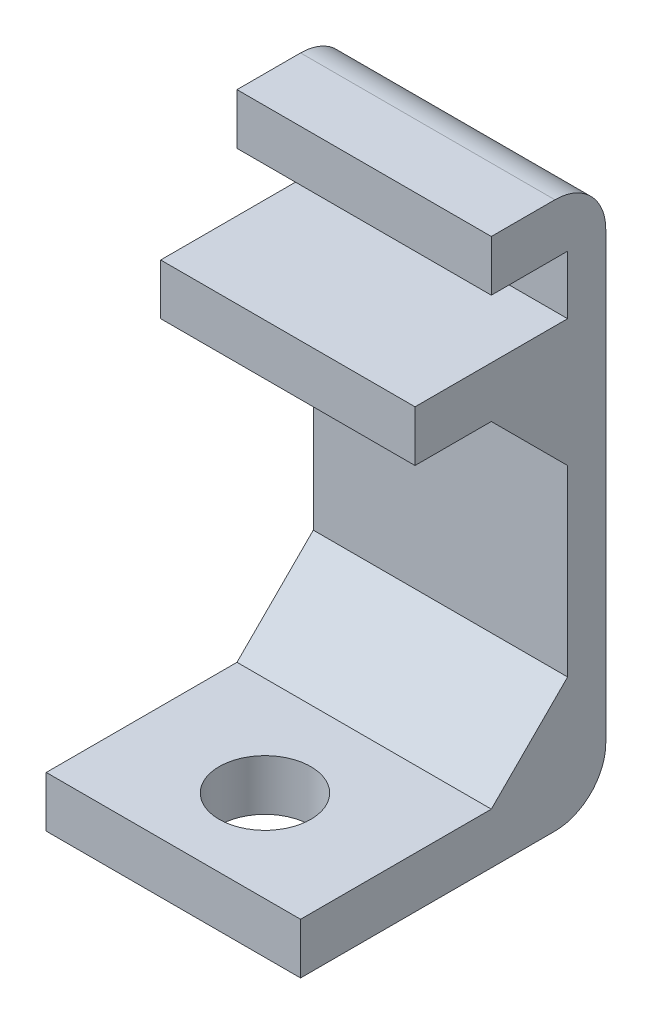
ISO-10303-21;
HEADER;
FILE_DESCRIPTION(('STEP AP214'),'2;1');
FILE_NAME('part.step','',(''),(''),'','','');
FILE_SCHEMA(('AUTOMOTIVE_DESIGN { 1 0 10303 214 1 1 1 1 }'));
ENDSEC;
DATA;
#1=APPLICATION_CONTEXT('core data for automotive mechanical design processes');
#2=APPLICATION_PROTOCOL_DEFINITION('international standard','automotive_design',2000,#1);
#3=PRODUCT_CONTEXT('',#1,'mechanical');
#4=PRODUCT('Part','Part','',(#3));
#5=PRODUCT_RELATED_PRODUCT_CATEGORY('part','',(#4));
#6=PRODUCT_DEFINITION_FORMATION('','',#4);
#7=PRODUCT_DEFINITION_CONTEXT('part definition',#1,'design');
#8=PRODUCT_DEFINITION('design','',#6,#7);
#9=PRODUCT_DEFINITION_SHAPE('','',#8);
#10=(LENGTH_UNIT() NAMED_UNIT(*) SI_UNIT(.MILLI.,.METRE.));
#11=(NAMED_UNIT(*) PLANE_ANGLE_UNIT() SI_UNIT($,.RADIAN.));
#12=(NAMED_UNIT(*) SI_UNIT($,.STERADIAN.) SOLID_ANGLE_UNIT());
#13=UNCERTAINTY_MEASURE_WITH_UNIT(LENGTH_MEASURE(1.E-05),#10,'distance_accuracy_value','');
#14=(GEOMETRIC_REPRESENTATION_CONTEXT(3) GLOBAL_UNCERTAINTY_ASSIGNED_CONTEXT((#13)) GLOBAL_UNIT_ASSIGNED_CONTEXT((#10,
#11,#12)) REPRESENTATION_CONTEXT('',''));
#15=CARTESIAN_POINT('',(0.,0.,0.));
#16=DIRECTION('',(0.,0.,1.));
#17=DIRECTION('',(1.,0.,0.));
#18=AXIS2_PLACEMENT_3D('',#15,#16,#17);
#19=CARTESIAN_POINT('',(5.,0.,0.750000000000002));
#20=DIRECTION('',(0.,0.,-1.));
#21=DIRECTION('',(-1.,0.,0.));
#22=AXIS2_PLACEMENT_3D('',#19,#20,#21);
#23=PLANE('',#22);
#24=DIRECTION('',(0.,-1.,0.));
#25=VECTOR('',#24,1.);
#26=CARTESIAN_POINT('',(-5.,0.,0.750000000000002));
#27=LINE('',#26,#25);
#28=CARTESIAN_POINT('',(-5.,6.45,0.750000000000002));
#29=VERTEX_POINT('',#28);
#30=CARTESIAN_POINT('',(-5.,4.45,0.750000000000002));
#31=VERTEX_POINT('',#30);
#32=EDGE_CURVE('E180',#29,#31,#27,.T.);
#33=ORIENTED_EDGE('',*,*,#32,.T.);
#34=DIRECTION('',(-1.,0.,0.));
#35=VECTOR('',#34,1.);
#36=CARTESIAN_POINT('',(5.,4.45,0.750000000000002));
#37=LINE('',#36,#35);
#38=CARTESIAN_POINT('',(5.,4.45,0.750000000000002));
#39=VERTEX_POINT('',#38);
#40=EDGE_CURVE('E163',#39,#31,#37,.T.);
#41=ORIENTED_EDGE('',*,*,#40,.F.);
#42=DIRECTION('',(0.,-1.,0.));
#43=VECTOR('',#42,1.);
#44=CARTESIAN_POINT('',(5.,0.,0.750000000000002));
#45=LINE('',#44,#43);
#46=CARTESIAN_POINT('',(5.,6.45,0.750000000000002));
#47=VERTEX_POINT('',#46);
#48=EDGE_CURVE('E169',#47,#39,#45,.T.);
#49=ORIENTED_EDGE('',*,*,#48,.F.);
#50=DIRECTION('',(-1.,0.,0.));
#51=VECTOR('',#50,1.);
#52=CARTESIAN_POINT('',(5.,6.45,0.750000000000002));
#53=LINE('',#52,#51);
#54=EDGE_CURVE('E256',#47,#29,#53,.T.);
#55=ORIENTED_EDGE('',*,*,#54,.T.);
#56=EDGE_LOOP('',(#33,#41,#49,#55));
#57=FACE_BOUND('',#56,.T.);
#58=ADVANCED_FACE('F41',(#57),#23,.F.);
#59=CARTESIAN_POINT('',(5.,4.45,0.));
#60=DIRECTION('',(0.,1.,0.));
#61=DIRECTION('',(0.,0.,1.));
#62=AXIS2_PLACEMENT_3D('',#59,#60,#61);
#63=PLANE('',#62);
#64=DIRECTION('',(0.,0.,-1.));
#65=VECTOR('',#64,1.);
#66=CARTESIAN_POINT('',(-5.,4.45,0.));
#67=LINE('',#66,#65);
#68=CARTESIAN_POINT('',(-5.,4.45,-2.25000000000001));
#69=VERTEX_POINT('',#68);
#70=EDGE_CURVE('E336',#31,#69,#67,.T.);
#71=ORIENTED_EDGE('',*,*,#70,.T.);
#72=DIRECTION('',(1.,0.,0.));
#73=VECTOR('',#72,1.);
#74=CARTESIAN_POINT('',(5.,4.45,-2.25000000000001));
#75=LINE('',#74,#73);
#76=CARTESIAN_POINT('',(5.,4.45,-2.25000000000001));
#77=VERTEX_POINT('',#76);
#78=EDGE_CURVE('E166',#69,#77,#75,.T.);
#79=ORIENTED_EDGE('',*,*,#78,.T.);
#80=DIRECTION('',(0.,0.,-1.));
#81=VECTOR('',#80,1.);
#82=CARTESIAN_POINT('',(5.,4.45,0.));
#83=LINE('',#82,#81);
#84=EDGE_CURVE('E158',#39,#77,#83,.T.);
#85=ORIENTED_EDGE('',*,*,#84,.F.);
#86=ORIENTED_EDGE('',*,*,#40,.T.);
#87=EDGE_LOOP('',(#71,#79,#85,#86));
#88=FACE_BOUND('',#87,.T.);
#89=ADVANCED_FACE('F161',(#88),#63,.F.);
#90=CARTESIAN_POINT('',(5.,0.,-5.25));
#91=DIRECTION('',(0.,0.,-1.));
#92=DIRECTION('',(-1.,0.,0.));
#93=AXIS2_PLACEMENT_3D('',#90,#91,#92);
#94=PLANE('',#93);
#95=DIRECTION('',(0.,-1.,0.));
#96=VECTOR('',#95,1.);
#97=CARTESIAN_POINT('',(-5.,0.,-5.25));
#98=LINE('',#97,#96);
#99=CARTESIAN_POINT('',(-5.,1.44999999999998,-5.25));
#100=VERTEX_POINT('',#99);
#101=CARTESIAN_POINT('',(-5.,-5.75000000000001,-5.25));
#102=VERTEX_POINT('',#101);
#103=EDGE_CURVE('E339',#100,#102,#98,.T.);
#104=ORIENTED_EDGE('',*,*,#103,.T.);
#105=DIRECTION('',(1.,0.,0.));
#106=VECTOR('',#105,1.);
#107=CARTESIAN_POINT('',(5.,-5.75000000000001,-5.25));
#108=LINE('',#107,#106);
#109=CARTESIAN_POINT('',(5.,-5.75000000000001,-5.25));
#110=VERTEX_POINT('',#109);
#111=EDGE_CURVE('E193',#102,#110,#108,.T.);
#112=ORIENTED_EDGE('',*,*,#111,.T.);
#113=DIRECTION('',(0.,-1.,0.));
#114=VECTOR('',#113,1.);
#115=CARTESIAN_POINT('',(5.,0.,-5.25));
#116=LINE('',#115,#114);
#117=CARTESIAN_POINT('',(5.,1.44999999999998,-5.25));
#118=VERTEX_POINT('',#117);
#119=EDGE_CURVE('E168',#118,#110,#116,.T.);
#120=ORIENTED_EDGE('',*,*,#119,.F.);
#121=DIRECTION('',(-1.,0.,0.));
#122=VECTOR('',#121,1.);
#123=CARTESIAN_POINT('',(-5.,1.44999999999998,-5.25));
#124=LINE('',#123,#122);
#125=EDGE_CURVE('E185',#118,#100,#124,.T.);
#126=ORIENTED_EDGE('',*,*,#125,.T.);
#127=EDGE_LOOP('',(#104,#112,#120,#126));
#128=FACE_BOUND('',#127,.T.);
#129=ADVANCED_FACE('F290',(#128),#94,.F.);
#130=CARTESIAN_POINT('',(5.,-8.75,0.));
#131=DIRECTION('',(0.,1.,0.));
#132=DIRECTION('',(0.,0.,1.));
#133=AXIS2_PLACEMENT_3D('',#130,#131,#132);
#134=PLANE('',#133);
#135=CARTESIAN_POINT('',(0.,-8.75,1.65));
#136=DIRECTION('',(0.,1.,0.));
#137=DIRECTION('',(0.,0.,1.));
#138=AXIS2_PLACEMENT_3D('',#135,#136,#137);
#139=CIRCLE('',#138,1.8);
#140=CARTESIAN_POINT('',(0.,-8.75,3.45));
#141=VERTEX_POINT('',#140);
#142=EDGE_CURVE('E337',#141,#141,#139,.F.);
#143=ORIENTED_EDGE('',*,*,#142,.T.);
#144=EDGE_LOOP('',(#143));
#145=FACE_BOUND('',#144,.T.);
#146=DIRECTION('',(0.,0.,-1.));
#147=VECTOR('',#146,1.);
#148=CARTESIAN_POINT('',(5.,-8.75,0.));
#149=LINE('',#148,#147);
#150=CARTESIAN_POINT('',(5.,-8.75,5.25));
#151=VERTEX_POINT('',#150);
#152=CARTESIAN_POINT('',(5.,-8.75,-2.24999999999998));
#153=VERTEX_POINT('',#152);
#154=EDGE_CURVE('E320',#151,#153,#149,.T.);
#155=ORIENTED_EDGE('',*,*,#154,.T.);
#156=DIRECTION('',(-1.,0.,0.));
#157=VECTOR('',#156,1.);
#158=CARTESIAN_POINT('',(5.,-8.75,-2.24999999999998));
#159=LINE('',#158,#157);
#160=CARTESIAN_POINT('',(-5.,-8.75,-2.24999999999998));
#161=VERTEX_POINT('',#160);
#162=EDGE_CURVE('E181',#153,#161,#159,.T.);
#163=ORIENTED_EDGE('',*,*,#162,.T.);
#164=DIRECTION('',(0.,0.,-1.));
#165=VECTOR('',#164,1.);
#166=CARTESIAN_POINT('',(-5.,-8.75,0.));
#167=LINE('',#166,#165);
#168=CARTESIAN_POINT('',(-5.,-8.75,5.25));
#169=VERTEX_POINT('',#168);
#170=EDGE_CURVE('E241',#169,#161,#167,.T.);
#171=ORIENTED_EDGE('',*,*,#170,.F.);
#172=DIRECTION('',(-1.,0.,0.));
#173=VECTOR('',#172,1.);
#174=CARTESIAN_POINT('',(5.,-8.75,5.25));
#175=LINE('',#174,#173);
#176=EDGE_CURVE('E182',#151,#169,#175,.T.);
#177=ORIENTED_EDGE('',*,*,#176,.F.);
#178=EDGE_LOOP('',(#155,#163,#171,#177));
#179=FACE_BOUND('',#178,.T.);
#180=ADVANCED_FACE('F343',(#145,#179),#134,.T.);
#181=CARTESIAN_POINT('',(5.,0.,5.25000000000001));
#182=DIRECTION('',(0.,0.,-1.));
#183=DIRECTION('',(0.,1.,0.));
#184=AXIS2_PLACEMENT_3D('',#181,#182,#183);
#185=PLANE('',#184);
#186=DIRECTION('',(0.,-1.,0.));
#187=VECTOR('',#186,1.);
#188=CARTESIAN_POINT('',(-5.,0.,5.25000000000001));
#189=LINE('',#188,#187);
#190=CARTESIAN_POINT('',(-5.,-10.75,5.25));
#191=VERTEX_POINT('',#190);
#192=EDGE_CURVE('E237',#169,#191,#189,.T.);
#193=ORIENTED_EDGE('',*,*,#192,.T.);
#194=DIRECTION('',(-1.,0.,0.));
#195=VECTOR('',#194,1.);
#196=CARTESIAN_POINT('',(5.,-10.75,5.25));
#197=LINE('',#196,#195);
#198=CARTESIAN_POINT('',(5.,-10.75,5.25));
#199=VERTEX_POINT('',#198);
#200=EDGE_CURVE('E187',#199,#191,#197,.T.);
#201=ORIENTED_EDGE('',*,*,#200,.F.);
#202=DIRECTION('',(0.,-1.,0.));
#203=VECTOR('',#202,1.);
#204=CARTESIAN_POINT('',(5.,0.,5.25000000000001));
#205=LINE('',#204,#203);
#206=EDGE_CURVE('E323',#151,#199,#205,.T.);
#207=ORIENTED_EDGE('',*,*,#206,.F.);
#208=ORIENTED_EDGE('',*,*,#176,.T.);
#209=EDGE_LOOP('',(#193,#201,#207,#208));
#210=FACE_BOUND('',#209,.T.);
#211=ADVANCED_FACE('F348',(#210),#185,.F.);
#212=CARTESIAN_POINT('',(5.,-10.75,0.));
#213=DIRECTION('',(0.,1.,0.));
#214=DIRECTION('',(0.,0.,1.));
#215=AXIS2_PLACEMENT_3D('',#212,#213,#214);
#216=PLANE('',#215);
#217=CARTESIAN_POINT('',(0.,-10.75,1.65));
#218=DIRECTION('',(0.,1.,0.));
#219=DIRECTION('',(0.,0.,1.));
#220=AXIS2_PLACEMENT_3D('',#217,#218,#219);
#221=CIRCLE('',#220,1.8);
#222=CARTESIAN_POINT('',(0.,-10.75,3.45));
#223=VERTEX_POINT('',#222);
#224=EDGE_CURVE('E495',#223,#223,#221,.T.);
#225=ORIENTED_EDGE('',*,*,#224,.T.);
#226=EDGE_LOOP('',(#225));
#227=FACE_BOUND('',#226,.T.);
#228=DIRECTION('',(0.,0.,-1.));
#229=VECTOR('',#228,1.);
#230=CARTESIAN_POINT('',(-5.,-10.75,0.));
#231=LINE('',#230,#229);
#232=CARTESIAN_POINT('',(-5.,-10.75,-4.75));
#233=VERTEX_POINT('',#232);
#234=EDGE_CURVE('E232',#191,#233,#231,.T.);
#235=ORIENTED_EDGE('',*,*,#234,.T.);
#236=DIRECTION('',(-1.,0.,0.));
#237=VECTOR('',#236,1.);
#238=CARTESIAN_POINT('',(5.,-10.75,-4.75));
#239=LINE('',#238,#237);
#240=CARTESIAN_POINT('',(5.,-10.75,-4.75));
#241=VERTEX_POINT('',#240);
#242=EDGE_CURVE('E64',#233,#241,#239,.F.);
#243=ORIENTED_EDGE('',*,*,#242,.T.);
#244=DIRECTION('',(0.,0.,-1.));
#245=VECTOR('',#244,1.);
#246=CARTESIAN_POINT('',(5.,-10.75,0.));
#247=LINE('',#246,#245);
#248=EDGE_CURVE('E217',#199,#241,#247,.T.);
#249=ORIENTED_EDGE('',*,*,#248,.F.);
#250=ORIENTED_EDGE('',*,*,#200,.T.);
#251=EDGE_LOOP('',(#235,#243,#249,#250));
#252=FACE_BOUND('',#251,.T.);
#253=ADVANCED_FACE('F235',(#227,#252),#216,.F.);
#254=CARTESIAN_POINT('',(5.,0.,-6.75));
#255=DIRECTION('',(0.,0.,-1.));
#256=DIRECTION('',(0.,1.,0.));
#257=AXIS2_PLACEMENT_3D('',#254,#255,#256);
#258=PLANE('',#257);
#259=DIRECTION('',(0.,-1.,0.));
#260=VECTOR('',#259,1.);
#261=CARTESIAN_POINT('',(5.,0.,-6.75));
#262=LINE('',#261,#260);
#263=CARTESIAN_POINT('',(5.,8.75,-6.75000000000001));
#264=VERTEX_POINT('',#263);
#265=CARTESIAN_POINT('',(5.,-8.75,-6.75));
#266=VERTEX_POINT('',#265);
#267=EDGE_CURVE('E216',#264,#266,#262,.T.);
#268=ORIENTED_EDGE('',*,*,#267,.T.);
#269=DIRECTION('',(-1.,0.,0.));
#270=VECTOR('',#269,1.);
#271=CARTESIAN_POINT('',(-5.,-8.75,-6.75));
#272=LINE('',#271,#270);
#273=CARTESIAN_POINT('',(-5.,-8.75,-6.75));
#274=VERTEX_POINT('',#273);
#275=EDGE_CURVE('E206',#266,#274,#272,.T.);
#276=ORIENTED_EDGE('',*,*,#275,.T.);
#277=DIRECTION('',(0.,-1.,0.));
#278=VECTOR('',#277,1.);
#279=CARTESIAN_POINT('',(-5.,0.,-6.75));
#280=LINE('',#279,#278);
#281=CARTESIAN_POINT('',(-5.,8.75,-6.75000000000001));
#282=VERTEX_POINT('',#281);
#283=EDGE_CURVE('E233',#282,#274,#280,.T.);
#284=ORIENTED_EDGE('',*,*,#283,.F.);
#285=DIRECTION('',(-1.,0.,0.));
#286=VECTOR('',#285,1.);
#287=CARTESIAN_POINT('',(5.,8.75,-6.75000000000001));
#288=LINE('',#287,#286);
#289=EDGE_CURVE('E204',#282,#264,#288,.F.);
#290=ORIENTED_EDGE('',*,*,#289,.T.);
#291=EDGE_LOOP('',(#268,#276,#284,#290));
#292=FACE_BOUND('',#291,.T.);
#293=ADVANCED_FACE('F221',(#292),#258,.T.);
#294=CARTESIAN_POINT('',(5.,10.75,0.));
#295=DIRECTION('',(0.,1.,0.));
#296=DIRECTION('',(0.,0.,1.));
#297=AXIS2_PLACEMENT_3D('',#294,#295,#296);
#298=PLANE('',#297);
#299=DIRECTION('',(0.,0.,-1.));
#300=VECTOR('',#299,1.);
#301=CARTESIAN_POINT('',(5.,10.75,0.));
#302=LINE('',#301,#300);
#303=CARTESIAN_POINT('',(5.,10.75,-2.25000000000001));
#304=VERTEX_POINT('',#303);
#305=CARTESIAN_POINT('',(5.,10.75,-4.75000000000001));
#306=VERTEX_POINT('',#305);
#307=EDGE_CURVE('E225',#304,#306,#302,.T.);
#308=ORIENTED_EDGE('',*,*,#307,.T.);
#309=DIRECTION('',(-1.,0.,0.));
#310=VECTOR('',#309,1.);
#311=CARTESIAN_POINT('',(5.,10.75,-4.75000000000001));
#312=LINE('',#311,#310);
#313=CARTESIAN_POINT('',(-5.,10.75,-4.75000000000001));
#314=VERTEX_POINT('',#313);
#315=EDGE_CURVE('E11',#306,#314,#312,.T.);
#316=ORIENTED_EDGE('',*,*,#315,.T.);
#317=DIRECTION('',(0.,0.,-1.));
#318=VECTOR('',#317,1.);
#319=CARTESIAN_POINT('',(-5.,10.75,0.));
#320=LINE('',#319,#318);
#321=CARTESIAN_POINT('',(-5.,10.75,-2.25000000000001));
#322=VERTEX_POINT('',#321);
#323=EDGE_CURVE('E239',#322,#314,#320,.T.);
#324=ORIENTED_EDGE('',*,*,#323,.F.);
#325=DIRECTION('',(-1.,0.,0.));
#326=VECTOR('',#325,1.);
#327=CARTESIAN_POINT('',(5.,10.75,-2.25000000000001));
#328=LINE('',#327,#326);
#329=EDGE_CURVE('E266',#304,#322,#328,.T.);
#330=ORIENTED_EDGE('',*,*,#329,.F.);
#331=EDGE_LOOP('',(#308,#316,#324,#330));
#332=FACE_BOUND('',#331,.T.);
#333=ADVANCED_FACE('F277',(#332),#298,.T.);
#334=CARTESIAN_POINT('',(5.,0.,-2.25000000000001));
#335=DIRECTION('',(0.,0.,-1.));
#336=DIRECTION('',(-1.,0.,0.));
#337=AXIS2_PLACEMENT_3D('',#334,#335,#336);
#338=PLANE('',#337);
#339=DIRECTION('',(0.,-1.,0.));
#340=VECTOR('',#339,1.);
#341=CARTESIAN_POINT('',(-5.,0.,-2.25000000000001));
#342=LINE('',#341,#340);
#343=CARTESIAN_POINT('',(-5.,8.75,-2.25000000000001));
#344=VERTEX_POINT('',#343);
#345=EDGE_CURVE('E247',#322,#344,#342,.T.);
#346=ORIENTED_EDGE('',*,*,#345,.T.);
#347=DIRECTION('',(-1.,0.,0.));
#348=VECTOR('',#347,1.);
#349=CARTESIAN_POINT('',(5.,8.75,-2.25000000000001));
#350=LINE('',#349,#348);
#351=CARTESIAN_POINT('',(5.,8.75,-2.25000000000001));
#352=VERTEX_POINT('',#351);
#353=EDGE_CURVE('E263',#352,#344,#350,.T.);
#354=ORIENTED_EDGE('',*,*,#353,.F.);
#355=DIRECTION('',(0.,-1.,0.));
#356=VECTOR('',#355,1.);
#357=CARTESIAN_POINT('',(5.,0.,-2.25000000000001));
#358=LINE('',#357,#356);
#359=EDGE_CURVE('E272',#304,#352,#358,.T.);
#360=ORIENTED_EDGE('',*,*,#359,.F.);
#361=ORIENTED_EDGE('',*,*,#329,.T.);
#362=EDGE_LOOP('',(#346,#354,#360,#361));
#363=FACE_BOUND('',#362,.T.);
#364=ADVANCED_FACE('F270',(#363),#338,.F.);
#365=CARTESIAN_POINT('',(5.,8.75,0.));
#366=DIRECTION('',(0.,1.,0.));
#367=DIRECTION('',(0.,0.,1.));
#368=AXIS2_PLACEMENT_3D('',#365,#366,#367);
#369=PLANE('',#368);
#370=DIRECTION('',(0.,0.,-1.));
#371=VECTOR('',#370,1.);
#372=CARTESIAN_POINT('',(-5.,8.75,0.));
#373=LINE('',#372,#371);
#374=CARTESIAN_POINT('',(-5.,8.75,-5.25));
#375=VERTEX_POINT('',#374);
#376=EDGE_CURVE('E249',#344,#375,#373,.T.);
#377=ORIENTED_EDGE('',*,*,#376,.T.);
#378=DIRECTION('',(-1.,0.,0.));
#379=VECTOR('',#378,1.);
#380=CARTESIAN_POINT('',(5.,8.75,-5.25));
#381=LINE('',#380,#379);
#382=CARTESIAN_POINT('',(5.,8.75,-5.25));
#383=VERTEX_POINT('',#382);
#384=EDGE_CURVE('E260',#383,#375,#381,.T.);
#385=ORIENTED_EDGE('',*,*,#384,.F.);
#386=DIRECTION('',(0.,0.,-1.));
#387=VECTOR('',#386,1.);
#388=CARTESIAN_POINT('',(5.,8.75,0.));
#389=LINE('',#388,#387);
#390=EDGE_CURVE('E330',#352,#383,#389,.T.);
#391=ORIENTED_EDGE('',*,*,#390,.F.);
#392=ORIENTED_EDGE('',*,*,#353,.T.);
#393=EDGE_LOOP('',(#377,#385,#391,#392));
#394=FACE_BOUND('',#393,.T.);
#395=ADVANCED_FACE('F448',(#394),#369,.F.);
#396=CARTESIAN_POINT('',(5.,0.,-5.25));
#397=DIRECTION('',(0.,0.,-1.));
#398=DIRECTION('',(-1.,0.,0.));
#399=AXIS2_PLACEMENT_3D('',#396,#397,#398);
#400=PLANE('',#399);
#401=DIRECTION('',(0.,-1.,0.));
#402=VECTOR('',#401,1.);
#403=CARTESIAN_POINT('',(-5.,0.,-5.25));
#404=LINE('',#403,#402);
#405=CARTESIAN_POINT('',(-5.,6.45,-5.25));
#406=VERTEX_POINT('',#405);
#407=EDGE_CURVE('E251',#375,#406,#404,.T.);
#408=ORIENTED_EDGE('',*,*,#407,.T.);
#409=DIRECTION('',(-1.,0.,0.));
#410=VECTOR('',#409,1.);
#411=CARTESIAN_POINT('',(5.,6.45,-5.25));
#412=LINE('',#411,#410);
#413=CARTESIAN_POINT('',(5.,6.45,-5.25));
#414=VERTEX_POINT('',#413);
#415=EDGE_CURVE('E258',#414,#406,#412,.T.);
#416=ORIENTED_EDGE('',*,*,#415,.F.);
#417=DIRECTION('',(0.,-1.,0.));
#418=VECTOR('',#417,1.);
#419=CARTESIAN_POINT('',(5.,0.,-5.25));
#420=LINE('',#419,#418);
#421=EDGE_CURVE('E332',#383,#414,#420,.T.);
#422=ORIENTED_EDGE('',*,*,#421,.F.);
#423=ORIENTED_EDGE('',*,*,#384,.T.);
#424=EDGE_LOOP('',(#408,#416,#422,#423));
#425=FACE_BOUND('',#424,.T.);
#426=ADVANCED_FACE('F444',(#425),#400,.F.);
#427=CARTESIAN_POINT('',(5.,6.45,0.));
#428=DIRECTION('',(0.,1.,0.));
#429=DIRECTION('',(0.,0.,1.));
#430=AXIS2_PLACEMENT_3D('',#427,#428,#429);
#431=PLANE('',#430);
#432=DIRECTION('',(0.,0.,-1.));
#433=VECTOR('',#432,1.);
#434=CARTESIAN_POINT('',(-5.,6.45,0.));
#435=LINE('',#434,#433);
#436=EDGE_CURVE('E177',#29,#406,#435,.T.);
#437=ORIENTED_EDGE('',*,*,#436,.F.);
#438=ORIENTED_EDGE('',*,*,#54,.F.);
#439=DIRECTION('',(0.,0.,-1.));
#440=VECTOR('',#439,1.);
#441=CARTESIAN_POINT('',(5.,6.45,0.));
#442=LINE('',#441,#440);
#443=EDGE_CURVE('E175',#47,#414,#442,.T.);
#444=ORIENTED_EDGE('',*,*,#443,.T.);
#445=ORIENTED_EDGE('',*,*,#415,.T.);
#446=EDGE_LOOP('',(#437,#438,#444,#445));
#447=FACE_BOUND('',#446,.T.);
#448=ADVANCED_FACE('F412',(#447),#431,.T.);
#449=CARTESIAN_POINT('',(5.,0.,0.));
#450=DIRECTION('',(1.,0.,0.));
#451=DIRECTION('',(0.,0.,-1.));
#452=AXIS2_PLACEMENT_3D('',#449,#450,#451);
#453=PLANE('',#452);
#454=ORIENTED_EDGE('',*,*,#248,.T.);
#455=CARTESIAN_POINT('',(5.,-8.75,-4.75));
#456=DIRECTION('',(1.,0.,0.));
#457=DIRECTION('',(0.,0.,-1.));
#458=AXIS2_PLACEMENT_3D('',#455,#456,#457);
#459=CIRCLE('',#458,2.);
#460=EDGE_CURVE('E49',#241,#266,#459,.T.);
#461=ORIENTED_EDGE('',*,*,#460,.T.);
#462=ORIENTED_EDGE('',*,*,#267,.F.);
#463=CARTESIAN_POINT('',(5.,8.75,-4.75000000000001));
#464=DIRECTION('',(1.,0.,0.));
#465=DIRECTION('',(0.,0.,-1.));
#466=AXIS2_PLACEMENT_3D('',#463,#464,#465);
#467=CIRCLE('',#466,2.);
#468=EDGE_CURVE('E56',#264,#306,#467,.T.);
#469=ORIENTED_EDGE('',*,*,#468,.T.);
#470=ORIENTED_EDGE('',*,*,#307,.F.);
#471=ORIENTED_EDGE('',*,*,#359,.T.);
#472=ORIENTED_EDGE('',*,*,#390,.T.);
#473=ORIENTED_EDGE('',*,*,#421,.T.);
#474=ORIENTED_EDGE('',*,*,#443,.F.);
#475=ORIENTED_EDGE('',*,*,#48,.T.);
#476=ORIENTED_EDGE('',*,*,#84,.T.);
#477=DIRECTION('',(0.,0.707106781186551,0.707106781186544));
#478=VECTOR('',#477,1.);
#479=CARTESIAN_POINT('',(5.,1.44999999999998,-5.25));
#480=LINE('',#479,#478);
#481=EDGE_CURVE('E202',#77,#118,#480,.F.);
#482=ORIENTED_EDGE('',*,*,#481,.T.);
#483=ORIENTED_EDGE('',*,*,#119,.T.);
#484=DIRECTION('',(0.,-0.707106781186544,0.707106781186551));
#485=VECTOR('',#484,1.);
#486=CARTESIAN_POINT('',(5.,-8.75,-2.24999999999998));
#487=LINE('',#486,#485);
#488=EDGE_CURVE('E198',#110,#153,#487,.T.);
#489=ORIENTED_EDGE('',*,*,#488,.T.);
#490=ORIENTED_EDGE('',*,*,#154,.F.);
#491=ORIENTED_EDGE('',*,*,#206,.T.);
#492=EDGE_LOOP('',(#454,#461,#462,#469,#470,#471,#472,#473,#474,#475,#476,#482,#483,#489,#490,#491));
#493=FACE_BOUND('',#492,.T.);
#494=ADVANCED_FACE('F173',(#493),#453,.T.);
#495=CARTESIAN_POINT('',(-5.,0.,0.));
#496=DIRECTION('',(1.,0.,0.));
#497=DIRECTION('',(0.,0.,-1.));
#498=AXIS2_PLACEMENT_3D('',#495,#496,#497);
#499=PLANE('',#498);
#500=ORIENTED_EDGE('',*,*,#283,.T.);
#501=CARTESIAN_POINT('',(-5.,-8.75,-4.75));
#502=DIRECTION('',(1.,0.,0.));
#503=DIRECTION('',(0.,0.,-1.));
#504=AXIS2_PLACEMENT_3D('',#501,#502,#503);
#505=CIRCLE('',#504,2.);
#506=EDGE_CURVE('E211',#274,#233,#505,.F.);
#507=ORIENTED_EDGE('',*,*,#506,.T.);
#508=ORIENTED_EDGE('',*,*,#234,.F.);
#509=ORIENTED_EDGE('',*,*,#192,.F.);
#510=ORIENTED_EDGE('',*,*,#170,.T.);
#511=DIRECTION('',(0.,0.707106781186544,-0.707106781186551));
#512=VECTOR('',#511,1.);
#513=CARTESIAN_POINT('',(-5.,-5.50000000000004,-5.49999999999998));
#514=LINE('',#513,#512);
#515=EDGE_CURVE('E196',#161,#102,#514,.T.);
#516=ORIENTED_EDGE('',*,*,#515,.T.);
#517=ORIENTED_EDGE('',*,*,#103,.F.);
#518=DIRECTION('',(0.,-0.707106781186551,-0.707106781186544));
#519=VECTOR('',#518,1.);
#520=CARTESIAN_POINT('',(-5.,3.34999999999998,-3.35000000000002));
#521=LINE('',#520,#519);
#522=EDGE_CURVE('E200',#100,#69,#521,.F.);
#523=ORIENTED_EDGE('',*,*,#522,.T.);
#524=ORIENTED_EDGE('',*,*,#70,.F.);
#525=ORIENTED_EDGE('',*,*,#32,.F.);
#526=ORIENTED_EDGE('',*,*,#436,.T.);
#527=ORIENTED_EDGE('',*,*,#407,.F.);
#528=ORIENTED_EDGE('',*,*,#376,.F.);
#529=ORIENTED_EDGE('',*,*,#345,.F.);
#530=ORIENTED_EDGE('',*,*,#323,.T.);
#531=CARTESIAN_POINT('',(-5.,8.75,-4.75000000000001));
#532=DIRECTION('',(1.,0.,0.));
#533=DIRECTION('',(0.,0.,-1.));
#534=AXIS2_PLACEMENT_3D('',#531,#532,#533);
#535=CIRCLE('',#534,2.);
#536=EDGE_CURVE('E209',#314,#282,#535,.F.);
#537=ORIENTED_EDGE('',*,*,#536,.T.);
#538=EDGE_LOOP('',(#500,#507,#508,#509,#510,#516,#517,#523,#524,#525,#526,#527,#528,#529,#530,#537));
#539=FACE_BOUND('',#538,.T.);
#540=ADVANCED_FACE('F230',(#539),#499,.F.);
#541=CARTESIAN_POINT('',(5.,-8.75,-2.24999999999998));
#542=DIRECTION('',(0.,-0.707106781186551,-0.707106781186544));
#543=DIRECTION('',(-1.,0.,0.));
#544=AXIS2_PLACEMENT_3D('',#541,#542,#543);
#545=PLANE('',#544);
#546=ORIENTED_EDGE('',*,*,#488,.F.);
#547=ORIENTED_EDGE('',*,*,#111,.F.);
#548=ORIENTED_EDGE('',*,*,#515,.F.);
#549=ORIENTED_EDGE('',*,*,#162,.F.);
#550=EDGE_LOOP('',(#546,#547,#548,#549));
#551=FACE_BOUND('',#550,.T.);
#552=ADVANCED_FACE('F295',(#551),#545,.F.);
#553=CARTESIAN_POINT('',(5.,1.44999999999998,-5.25));
#554=DIRECTION('',(0.,-0.707106781186544,0.707106781186551));
#555=DIRECTION('',(1.,0.,0.));
#556=AXIS2_PLACEMENT_3D('',#553,#554,#555);
#557=PLANE('',#556);
#558=ORIENTED_EDGE('',*,*,#481,.F.);
#559=ORIENTED_EDGE('',*,*,#78,.F.);
#560=ORIENTED_EDGE('',*,*,#522,.F.);
#561=ORIENTED_EDGE('',*,*,#125,.F.);
#562=EDGE_LOOP('',(#558,#559,#560,#561));
#563=FACE_BOUND('',#562,.T.);
#564=ADVANCED_FACE('F301',(#563),#557,.T.);
#565=CARTESIAN_POINT('',(0.,-5.75,1.65));
#566=DIRECTION('',(0.,-1.,0.));
#567=DIRECTION('',(0.,0.,-1.));
#568=AXIS2_PLACEMENT_3D('',#565,#566,#567);
#569=CYLINDRICAL_SURFACE('',#568,1.8);
#570=ORIENTED_EDGE('',*,*,#142,.F.);
#571=EDGE_LOOP('',(#570));
#572=FACE_BOUND('',#571,.T.);
#573=ORIENTED_EDGE('',*,*,#224,.F.);
#574=EDGE_LOOP('',(#573));
#575=FACE_BOUND('',#574,.T.);
#576=ADVANCED_FACE('F284',(#572,#575),#569,.F.);
#577=CARTESIAN_POINT('',(5.,-8.75,-4.75));
#578=DIRECTION('',(1.,0.,0.));
#579=DIRECTION('',(0.,0.,-1.));
#580=AXIS2_PLACEMENT_3D('',#577,#578,#579);
#581=CYLINDRICAL_SURFACE('',#580,2.);
#582=ORIENTED_EDGE('',*,*,#460,.F.);
#583=ORIENTED_EDGE('',*,*,#242,.F.);
#584=ORIENTED_EDGE('',*,*,#506,.F.);
#585=ORIENTED_EDGE('',*,*,#275,.F.);
#586=EDGE_LOOP('',(#582,#583,#584,#585));
#587=FACE_BOUND('',#586,.T.);
#588=ADVANCED_FACE('F227',(#587),#581,.T.);
#589=CARTESIAN_POINT('',(5.,8.75,-4.75000000000001));
#590=DIRECTION('',(-1.,0.,0.));
#591=DIRECTION('',(0.,0.,1.));
#592=AXIS2_PLACEMENT_3D('',#589,#590,#591);
#593=CYLINDRICAL_SURFACE('',#592,2.);
#594=ORIENTED_EDGE('',*,*,#468,.F.);
#595=ORIENTED_EDGE('',*,*,#289,.F.);
#596=ORIENTED_EDGE('',*,*,#536,.F.);
#597=ORIENTED_EDGE('',*,*,#315,.F.);
#598=EDGE_LOOP('',(#594,#595,#596,#597));
#599=FACE_BOUND('',#598,.T.);
#600=ADVANCED_FACE('F43',(#599),#593,.T.);
#601=CLOSED_SHELL('',(#58,#89,#129,#180,#211,#253,#293,#333,#364,#395,#426,#448,#494,#540,#552,
#564,#576,#588,#600));
#602=MANIFOLD_SOLID_BREP('B2',#601);
#603=ADVANCED_BREP_SHAPE_REPRESENTATION('',(#18,#602),#14);
#604=SHAPE_DEFINITION_REPRESENTATION(#9,#603);
ENDSEC;
END-ISO-10303-21;
